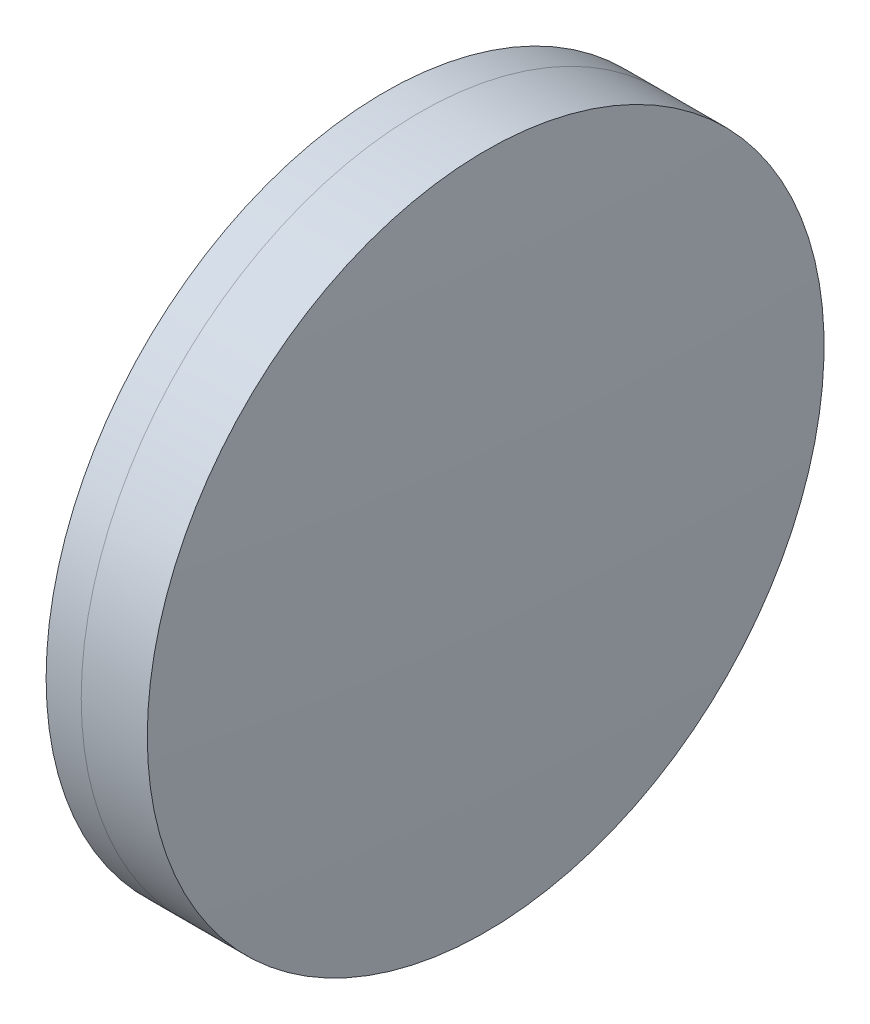
ISO-10303-21;
HEADER;
FILE_DESCRIPTION(('STEP AP214'),'2;1');
FILE_NAME('part.step','',(''),(''),'','','');
FILE_SCHEMA(('AUTOMOTIVE_DESIGN { 1 0 10303 214 1 1 1 1 }'));
ENDSEC;
DATA;
#1=APPLICATION_CONTEXT('core data for automotive mechanical design processes');
#2=APPLICATION_PROTOCOL_DEFINITION('international standard','automotive_design',2000,#1);
#3=PRODUCT_CONTEXT('',#1,'mechanical');
#4=PRODUCT('Part','Part','',(#3));
#5=PRODUCT_RELATED_PRODUCT_CATEGORY('part','',(#4));
#6=PRODUCT_DEFINITION_FORMATION('','',#4);
#7=PRODUCT_DEFINITION_CONTEXT('part definition',#1,'design');
#8=PRODUCT_DEFINITION('design','',#6,#7);
#9=PRODUCT_DEFINITION_SHAPE('','',#8);
#10=(LENGTH_UNIT() NAMED_UNIT(*) SI_UNIT(.MILLI.,.METRE.));
#11=(NAMED_UNIT(*) PLANE_ANGLE_UNIT() SI_UNIT($,.RADIAN.));
#12=(NAMED_UNIT(*) SI_UNIT($,.STERADIAN.) SOLID_ANGLE_UNIT());
#13=UNCERTAINTY_MEASURE_WITH_UNIT(LENGTH_MEASURE(1.E-05),#10,'distance_accuracy_value','');
#14=(GEOMETRIC_REPRESENTATION_CONTEXT(3) GLOBAL_UNCERTAINTY_ASSIGNED_CONTEXT((#13)) GLOBAL_UNIT_ASSIGNED_CONTEXT((#10,
#11,#12)) REPRESENTATION_CONTEXT('',''));
#15=CARTESIAN_POINT('',(0.,0.,0.));
#16=DIRECTION('',(0.,0.,1.));
#17=DIRECTION('',(1.,0.,0.));
#18=AXIS2_PLACEMENT_3D('',#15,#16,#17);
#19=CARTESIAN_POINT('',(14.8796689735747,0.,0.));
#20=DIRECTION('',(-1.,0.,0.));
#21=DIRECTION('',(0.,0.,1.));
#22=AXIS2_PLACEMENT_3D('',#19,#20,#21);
#23=SPHERICAL_SURFACE('',#22,65.142);
#24=CARTESIAN_POINT('',(78.8111179169547,0.,0.));
#25=DIRECTION('',(-1.,0.,0.));
#26=DIRECTION('',(0.,0.,1.));
#27=AXIS2_PLACEMENT_3D('',#24,#25,#26);
#28=CIRCLE('',#27,12.5);
#29=CARTESIAN_POINT('',(78.8111179169547,0.,12.5));
#30=VERTEX_POINT('',#29);
#31=EDGE_CURVE('E11',#30,#30,#28,.T.);
#32=ORIENTED_EDGE('',*,*,#31,.T.);
#33=EDGE_LOOP('',(#32));
#34=FACE_BOUND('',#33,.T.);
#35=ADVANCED_FACE('F45',(#34),#23,.F.);
#36=CARTESIAN_POINT('',(-0.551919992657797,0.,0.));
#37=DIRECTION('',(-1.,0.,0.));
#38=DIRECTION('',(0.,0.,1.));
#39=AXIS2_PLACEMENT_3D('',#36,#37,#38);
#40=CYLINDRICAL_SURFACE('',#39,12.5);
#41=CARTESIAN_POINT('',(81.2518448917064,0.,0.));
#42=DIRECTION('',(-1.,0.,0.));
#43=DIRECTION('',(0.,0.,1.));
#44=AXIS2_PLACEMENT_3D('',#41,#42,#43);
#45=CIRCLE('',#44,12.5);
#46=CARTESIAN_POINT('',(81.2518448917064,0.,12.5));
#47=VERTEX_POINT('',#46);
#48=EDGE_CURVE('E51',#47,#47,#45,.T.);
#49=ORIENTED_EDGE('',*,*,#48,.T.);
#50=EDGE_LOOP('',(#49));
#51=FACE_BOUND('',#50,.T.);
#52=ORIENTED_EDGE('',*,*,#31,.F.);
#53=EDGE_LOOP('',(#52));
#54=FACE_BOUND('',#53,.T.);
#55=ADVANCED_FACE('F57',(#51,#54),#40,.T.);
#56=CARTESIAN_POINT('',(-129.812331026425,0.,0.));
#57=DIRECTION('',(-1.,0.,0.));
#58=DIRECTION('',(0.,0.,1.));
#59=AXIS2_PLACEMENT_3D('',#56,#57,#58);
#60=SPHERICAL_SURFACE('',#59,211.434);
#61=ORIENTED_EDGE('',*,*,#48,.F.);
#62=EDGE_LOOP('',(#61));
#63=FACE_BOUND('',#62,.T.);
#64=ADVANCED_FACE('F60',(#63),#60,.T.);
#65=CLOSED_SHELL('',(#35,#55,#64));
#66=MANIFOLD_SOLID_BREP('B2',#65);
#67=CARTESIAN_POINT('',(175.658668973575,0.,0.));
#68=DIRECTION('',(-1.,0.,0.));
#69=DIRECTION('',(0.,0.,1.));
#70=AXIS2_PLACEMENT_3D('',#67,#68,#69);
#71=SPHERICAL_SURFACE('',#70,98.937);
#72=CARTESIAN_POINT('',(77.5144894772847,0.,0.));
#73=DIRECTION('',(-1.,0.,0.));
#74=DIRECTION('',(0.,0.,1.));
#75=AXIS2_PLACEMENT_3D('',#72,#73,#74);
#76=CIRCLE('',#75,12.5);
#77=CARTESIAN_POINT('',(77.5144894772847,0.,12.5));
#78=VERTEX_POINT('',#77);
#79=EDGE_CURVE('E44',#78,#78,#76,.T.);
#80=ORIENTED_EDGE('',*,*,#79,.T.);
#81=EDGE_LOOP('',(#80));
#82=FACE_BOUND('',#81,.T.);
#83=ADVANCED_FACE('F86',(#82),#71,.T.);
#84=CARTESIAN_POINT('',(-9.70261217833668,0.,0.));
#85=DIRECTION('',(-1.,0.,0.));
#86=DIRECTION('',(0.,0.,1.));
#87=AXIS2_PLACEMENT_3D('',#84,#85,#86);
#88=CYLINDRICAL_SURFACE('',#87,12.5);
#89=CARTESIAN_POINT('',(78.8111179169547,0.,0.));
#90=DIRECTION('',(-1.,0.,0.));
#91=DIRECTION('',(0.,0.,1.));
#92=AXIS2_PLACEMENT_3D('',#89,#90,#91);
#93=CIRCLE('',#92,12.5);
#94=CARTESIAN_POINT('',(78.8111179169547,0.,12.5));
#95=VERTEX_POINT('',#94);
#96=EDGE_CURVE('E92',#95,#95,#93,.T.);
#97=ORIENTED_EDGE('',*,*,#96,.T.);
#98=EDGE_LOOP('',(#97));
#99=FACE_BOUND('',#98,.T.);
#100=ORIENTED_EDGE('',*,*,#79,.F.);
#101=EDGE_LOOP('',(#100));
#102=FACE_BOUND('',#101,.T.);
#103=ADVANCED_FACE('F98',(#99,#102),#88,.T.);
#104=CARTESIAN_POINT('',(14.8796689735747,0.,0.));
#105=DIRECTION('',(-1.,0.,0.));
#106=DIRECTION('',(0.,0.,1.));
#107=AXIS2_PLACEMENT_3D('',#104,#105,#106);
#108=SPHERICAL_SURFACE('',#107,65.142);
#109=ORIENTED_EDGE('',*,*,#96,.F.);
#110=EDGE_LOOP('',(#109));
#111=FACE_BOUND('',#110,.T.);
#112=ADVANCED_FACE('F101',(#111),#108,.T.);
#113=CLOSED_SHELL('',(#83,#103,#112));
#114=MANIFOLD_SOLID_BREP('B6',#113);
#115=ADVANCED_BREP_SHAPE_REPRESENTATION('',(#18,#66,#114),#14);
#116=SHAPE_DEFINITION_REPRESENTATION(#9,#115);
ENDSEC;
END-ISO-10303-21;
